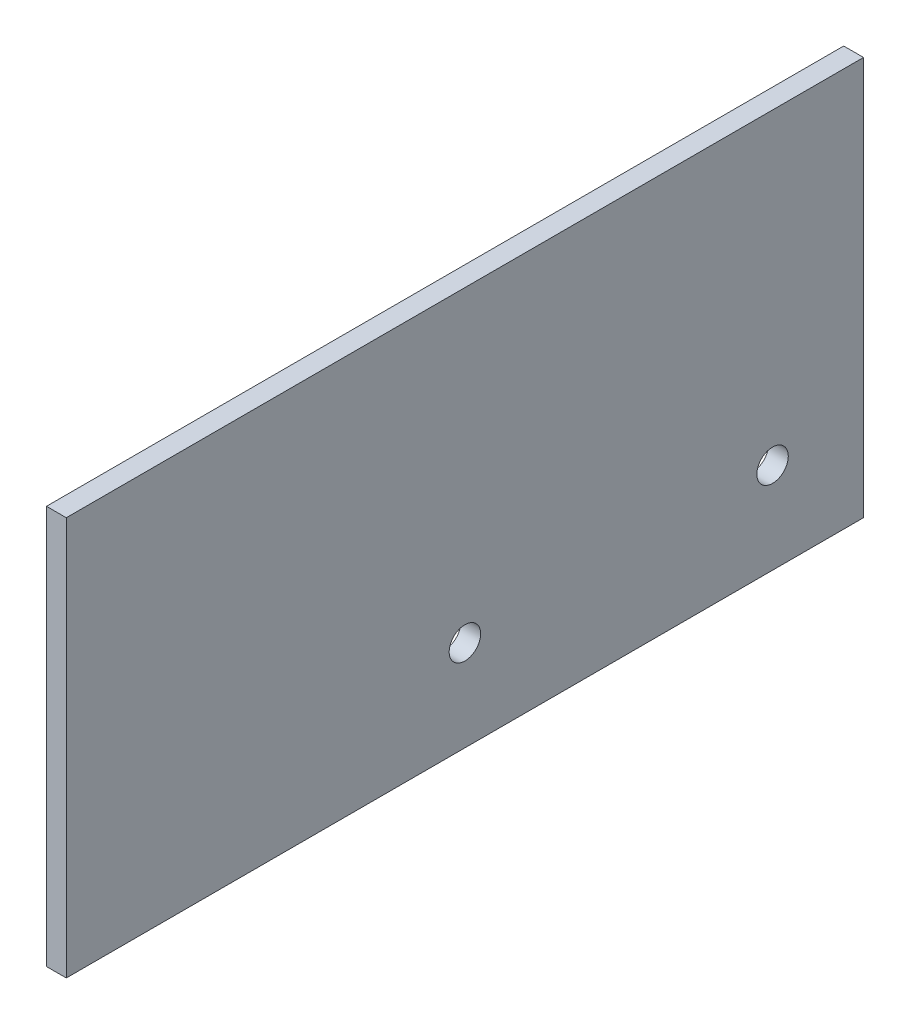
ISO-10303-21;
HEADER;
FILE_DESCRIPTION(('STEP AP214'),'2;1');
FILE_NAME('part.step','',(''),(''),'','','');
FILE_SCHEMA(('AUTOMOTIVE_DESIGN { 1 0 10303 214 1 1 1 1 }'));
ENDSEC;
DATA;
#1=APPLICATION_CONTEXT('core data for automotive mechanical design processes');
#2=APPLICATION_PROTOCOL_DEFINITION('international standard','automotive_design',2000,#1);
#3=PRODUCT_CONTEXT('',#1,'mechanical');
#4=PRODUCT('Part','Part','',(#3));
#5=PRODUCT_RELATED_PRODUCT_CATEGORY('part','',(#4));
#6=PRODUCT_DEFINITION_FORMATION('','',#4);
#7=PRODUCT_DEFINITION_CONTEXT('part definition',#1,'design');
#8=PRODUCT_DEFINITION('design','',#6,#7);
#9=PRODUCT_DEFINITION_SHAPE('','',#8);
#10=(LENGTH_UNIT() NAMED_UNIT(*) SI_UNIT(.MILLI.,.METRE.));
#11=(NAMED_UNIT(*) PLANE_ANGLE_UNIT() SI_UNIT($,.RADIAN.));
#12=(NAMED_UNIT(*) SI_UNIT($,.STERADIAN.) SOLID_ANGLE_UNIT());
#13=UNCERTAINTY_MEASURE_WITH_UNIT(LENGTH_MEASURE(1.E-05),#10,'distance_accuracy_value','');
#14=(GEOMETRIC_REPRESENTATION_CONTEXT(3) GLOBAL_UNCERTAINTY_ASSIGNED_CONTEXT((#13)) GLOBAL_UNIT_ASSIGNED_CONTEXT((#10,
#11,#12)) REPRESENTATION_CONTEXT('',''));
#15=CARTESIAN_POINT('',(0.,0.,0.));
#16=DIRECTION('',(0.,0.,1.));
#17=DIRECTION('',(1.,0.,0.));
#18=AXIS2_PLACEMENT_3D('',#15,#16,#17);
#19=CARTESIAN_POINT('',(2.25,0.,-90.5));
#20=DIRECTION('',(0.,-1.,0.));
#21=DIRECTION('',(0.,0.,-1.));
#22=AXIS2_PLACEMENT_3D('',#19,#20,#21);
#23=PLANE('',#22);
#24=DIRECTION('',(0.,0.,1.));
#25=VECTOR('',#24,1.);
#26=CARTESIAN_POINT('',(-2.25,0.,-90.5));
#27=LINE('',#26,#25);
#28=CARTESIAN_POINT('',(-2.25,0.,-90.5));
#29=VERTEX_POINT('',#28);
#30=CARTESIAN_POINT('',(-2.25,0.,90.5));
#31=VERTEX_POINT('',#30);
#32=EDGE_CURVE('E95',#29,#31,#27,.T.);
#33=ORIENTED_EDGE('',*,*,#32,.T.);
#34=DIRECTION('',(-1.,0.,0.));
#35=VECTOR('',#34,1.);
#36=CARTESIAN_POINT('',(2.25,0.,90.5));
#37=LINE('',#36,#35);
#38=CARTESIAN_POINT('',(2.25,0.,90.5));
#39=VERTEX_POINT('',#38);
#40=EDGE_CURVE('E11',#39,#31,#37,.T.);
#41=ORIENTED_EDGE('',*,*,#40,.F.);
#42=DIRECTION('',(0.,0.,1.));
#43=VECTOR('',#42,1.);
#44=CARTESIAN_POINT('',(2.25,0.,-90.5));
#45=LINE('',#44,#43);
#46=CARTESIAN_POINT('',(2.25,0.,-90.5));
#47=VERTEX_POINT('',#46);
#48=EDGE_CURVE('E83',#47,#39,#45,.T.);
#49=ORIENTED_EDGE('',*,*,#48,.F.);
#50=DIRECTION('',(-1.,0.,0.));
#51=VECTOR('',#50,1.);
#52=CARTESIAN_POINT('',(2.25,0.,-90.5));
#53=LINE('',#52,#51);
#54=EDGE_CURVE('E91',#47,#29,#53,.T.);
#55=ORIENTED_EDGE('',*,*,#54,.T.);
#56=EDGE_LOOP('',(#33,#41,#49,#55));
#57=FACE_BOUND('',#56,.T.);
#58=ADVANCED_FACE('F32',(#57),#23,.F.);
#59=CARTESIAN_POINT('',(2.25,0.,90.5));
#60=DIRECTION('',(0.,0.,-1.));
#61=DIRECTION('',(-1.,0.,0.));
#62=AXIS2_PLACEMENT_3D('',#59,#60,#61);
#63=PLANE('',#62);
#64=DIRECTION('',(0.,-1.,0.));
#65=VECTOR('',#64,1.);
#66=CARTESIAN_POINT('',(-2.25,0.,90.5));
#67=LINE('',#66,#65);
#68=CARTESIAN_POINT('',(-2.25,-90.5,90.5));
#69=VERTEX_POINT('',#68);
#70=EDGE_CURVE('E87',#31,#69,#67,.T.);
#71=ORIENTED_EDGE('',*,*,#70,.T.);
#72=DIRECTION('',(-1.,0.,0.));
#73=VECTOR('',#72,1.);
#74=CARTESIAN_POINT('',(2.25,-90.5,90.5));
#75=LINE('',#74,#73);
#76=CARTESIAN_POINT('',(2.25,-90.5,90.5));
#77=VERTEX_POINT('',#76);
#78=EDGE_CURVE('E40',#77,#69,#75,.T.);
#79=ORIENTED_EDGE('',*,*,#78,.F.);
#80=DIRECTION('',(0.,-1.,0.));
#81=VECTOR('',#80,1.);
#82=CARTESIAN_POINT('',(2.25,0.,90.5));
#83=LINE('',#82,#81);
#84=EDGE_CURVE('E78',#39,#77,#83,.T.);
#85=ORIENTED_EDGE('',*,*,#84,.F.);
#86=ORIENTED_EDGE('',*,*,#40,.T.);
#87=EDGE_LOOP('',(#71,#79,#85,#86));
#88=FACE_BOUND('',#87,.T.);
#89=ADVANCED_FACE('F86',(#88),#63,.F.);
#90=CARTESIAN_POINT('',(2.25,-90.5,90.5));
#91=DIRECTION('',(0.,1.,0.));
#92=DIRECTION('',(0.,0.,1.));
#93=AXIS2_PLACEMENT_3D('',#90,#91,#92);
#94=PLANE('',#93);
#95=DIRECTION('',(0.,0.,-1.));
#96=VECTOR('',#95,1.);
#97=CARTESIAN_POINT('',(-2.25,-90.5,90.5));
#98=LINE('',#97,#96);
#99=CARTESIAN_POINT('',(-2.25,-90.5,-90.5));
#100=VERTEX_POINT('',#99);
#101=EDGE_CURVE('E65',#69,#100,#98,.T.);
#102=ORIENTED_EDGE('',*,*,#101,.T.);
#103=DIRECTION('',(-1.,0.,0.));
#104=VECTOR('',#103,1.);
#105=CARTESIAN_POINT('',(2.25,-90.5,-90.5));
#106=LINE('',#105,#104);
#107=CARTESIAN_POINT('',(2.25,-90.5,-90.5));
#108=VERTEX_POINT('',#107);
#109=EDGE_CURVE('E88',#108,#100,#106,.T.);
#110=ORIENTED_EDGE('',*,*,#109,.F.);
#111=DIRECTION('',(0.,0.,-1.));
#112=VECTOR('',#111,1.);
#113=CARTESIAN_POINT('',(2.25,-90.5,90.5));
#114=LINE('',#113,#112);
#115=EDGE_CURVE('E81',#77,#108,#114,.T.);
#116=ORIENTED_EDGE('',*,*,#115,.F.);
#117=ORIENTED_EDGE('',*,*,#78,.T.);
#118=EDGE_LOOP('',(#102,#110,#116,#117));
#119=FACE_BOUND('',#118,.T.);
#120=ADVANCED_FACE('F89',(#119),#94,.F.);
#121=CARTESIAN_POINT('',(2.25,-90.5,-90.5));
#122=DIRECTION('',(0.,0.,1.));
#123=DIRECTION('',(1.,0.,0.));
#124=AXIS2_PLACEMENT_3D('',#121,#122,#123);
#125=PLANE('',#124);
#126=DIRECTION('',(0.,1.,0.));
#127=VECTOR('',#126,1.);
#128=CARTESIAN_POINT('',(-2.25,-90.5,-90.5));
#129=LINE('',#128,#127);
#130=EDGE_CURVE('E71',#100,#29,#129,.T.);
#131=ORIENTED_EDGE('',*,*,#130,.T.);
#132=ORIENTED_EDGE('',*,*,#54,.F.);
#133=DIRECTION('',(0.,1.,0.));
#134=VECTOR('',#133,1.);
#135=CARTESIAN_POINT('',(2.25,-90.5,-90.5));
#136=LINE('',#135,#134);
#137=EDGE_CURVE('E48',#108,#47,#136,.T.);
#138=ORIENTED_EDGE('',*,*,#137,.F.);
#139=ORIENTED_EDGE('',*,*,#109,.T.);
#140=EDGE_LOOP('',(#131,#132,#138,#139));
#141=FACE_BOUND('',#140,.T.);
#142=ADVANCED_FACE('F103',(#141),#125,.F.);
#143=CARTESIAN_POINT('',(2.25,0.,0.));
#144=DIRECTION('',(1.,0.,0.));
#145=DIRECTION('',(0.,0.,-1.));
#146=AXIS2_PLACEMENT_3D('',#143,#144,#145);
#147=PLANE('',#146);
#148=CARTESIAN_POINT('',(2.25,-69.85,-69.85));
#149=DIRECTION('',(1.,0.,0.));
#150=DIRECTION('',(0.,0.,-1.));
#151=AXIS2_PLACEMENT_3D('',#148,#149,#150);
#152=CIRCLE('',#151,3.56870000000001);
#153=CARTESIAN_POINT('',(2.25,-69.85,-73.4187));
#154=VERTEX_POINT('',#153);
#155=EDGE_CURVE('E114',#154,#154,#152,.T.);
#156=ORIENTED_EDGE('',*,*,#155,.F.);
#157=EDGE_LOOP('',(#156));
#158=FACE_BOUND('',#157,.T.);
#159=CARTESIAN_POINT('',(2.25,-69.85,0.));
#160=DIRECTION('',(1.,0.,0.));
#161=DIRECTION('',(0.,0.,-1.));
#162=AXIS2_PLACEMENT_3D('',#159,#160,#161);
#163=CIRCLE('',#162,3.56870000000001);
#164=CARTESIAN_POINT('',(2.25,-69.85,-3.56870000000001));
#165=VERTEX_POINT('',#164);
#166=EDGE_CURVE('E98',#165,#165,#163,.T.);
#167=ORIENTED_EDGE('',*,*,#166,.F.);
#168=EDGE_LOOP('',(#167));
#169=FACE_BOUND('',#168,.T.);
#170=ORIENTED_EDGE('',*,*,#48,.T.);
#171=ORIENTED_EDGE('',*,*,#84,.T.);
#172=ORIENTED_EDGE('',*,*,#115,.T.);
#173=ORIENTED_EDGE('',*,*,#137,.T.);
#174=EDGE_LOOP('',(#170,#171,#172,#173));
#175=FACE_BOUND('',#174,.T.);
#176=ADVANCED_FACE('F79',(#158,#169,#175),#147,.T.);
#177=CARTESIAN_POINT('',(-2.25,0.,0.));
#178=DIRECTION('',(1.,0.,0.));
#179=DIRECTION('',(0.,0.,-1.));
#180=AXIS2_PLACEMENT_3D('',#177,#178,#179);
#181=PLANE('',#180);
#182=CARTESIAN_POINT('',(-2.25,-69.85,-69.85));
#183=DIRECTION('',(1.,0.,0.));
#184=DIRECTION('',(0.,0.,-1.));
#185=AXIS2_PLACEMENT_3D('',#182,#183,#184);
#186=CIRCLE('',#185,3.56870000000001);
#187=CARTESIAN_POINT('',(-2.25,-69.85,-73.4187));
#188=VERTEX_POINT('',#187);
#189=EDGE_CURVE('E117',#188,#188,#186,.T.);
#190=ORIENTED_EDGE('',*,*,#189,.T.);
#191=EDGE_LOOP('',(#190));
#192=FACE_BOUND('',#191,.T.);
#193=CARTESIAN_POINT('',(-2.25,-69.85,0.));
#194=DIRECTION('',(1.,0.,0.));
#195=DIRECTION('',(0.,0.,-1.));
#196=AXIS2_PLACEMENT_3D('',#193,#194,#195);
#197=CIRCLE('',#196,3.56870000000001);
#198=CARTESIAN_POINT('',(-2.25,-69.85,-3.56870000000001));
#199=VERTEX_POINT('',#198);
#200=EDGE_CURVE('E111',#199,#199,#197,.T.);
#201=ORIENTED_EDGE('',*,*,#200,.T.);
#202=EDGE_LOOP('',(#201));
#203=FACE_BOUND('',#202,.T.);
#204=ORIENTED_EDGE('',*,*,#32,.F.);
#205=ORIENTED_EDGE('',*,*,#130,.F.);
#206=ORIENTED_EDGE('',*,*,#101,.F.);
#207=ORIENTED_EDGE('',*,*,#70,.F.);
#208=EDGE_LOOP('',(#204,#205,#206,#207));
#209=FACE_BOUND('',#208,.T.);
#210=ADVANCED_FACE('F106',(#192,#203,#209),#181,.F.);
#211=CARTESIAN_POINT('',(-2.25,-69.85,0.));
#212=DIRECTION('',(1.,0.,0.));
#213=DIRECTION('',(0.,0.,-1.));
#214=AXIS2_PLACEMENT_3D('',#211,#212,#213);
#215=CYLINDRICAL_SURFACE('',#214,3.56870000000001);
#216=ORIENTED_EDGE('',*,*,#166,.T.);
#217=EDGE_LOOP('',(#216));
#218=FACE_BOUND('',#217,.T.);
#219=ORIENTED_EDGE('',*,*,#200,.F.);
#220=EDGE_LOOP('',(#219));
#221=FACE_BOUND('',#220,.T.);
#222=ADVANCED_FACE('F125',(#218,#221),#215,.F.);
#223=CARTESIAN_POINT('',(-2.25,-69.85,-69.85));
#224=DIRECTION('',(1.,0.,0.));
#225=DIRECTION('',(0.,0.,-1.));
#226=AXIS2_PLACEMENT_3D('',#223,#224,#225);
#227=CYLINDRICAL_SURFACE('',#226,3.56870000000001);
#228=ORIENTED_EDGE('',*,*,#155,.T.);
#229=EDGE_LOOP('',(#228));
#230=FACE_BOUND('',#229,.T.);
#231=ORIENTED_EDGE('',*,*,#189,.F.);
#232=EDGE_LOOP('',(#231));
#233=FACE_BOUND('',#232,.T.);
#234=ADVANCED_FACE('F123',(#230,#233),#227,.F.);
#235=CLOSED_SHELL('',(#58,#89,#120,#142,#176,#210,#222,#234));
#236=MANIFOLD_SOLID_BREP('B2',#235);
#237=ADVANCED_BREP_SHAPE_REPRESENTATION('',(#18,#236),#14);
#238=SHAPE_DEFINITION_REPRESENTATION(#9,#237);
ENDSEC;
END-ISO-10303-21;
